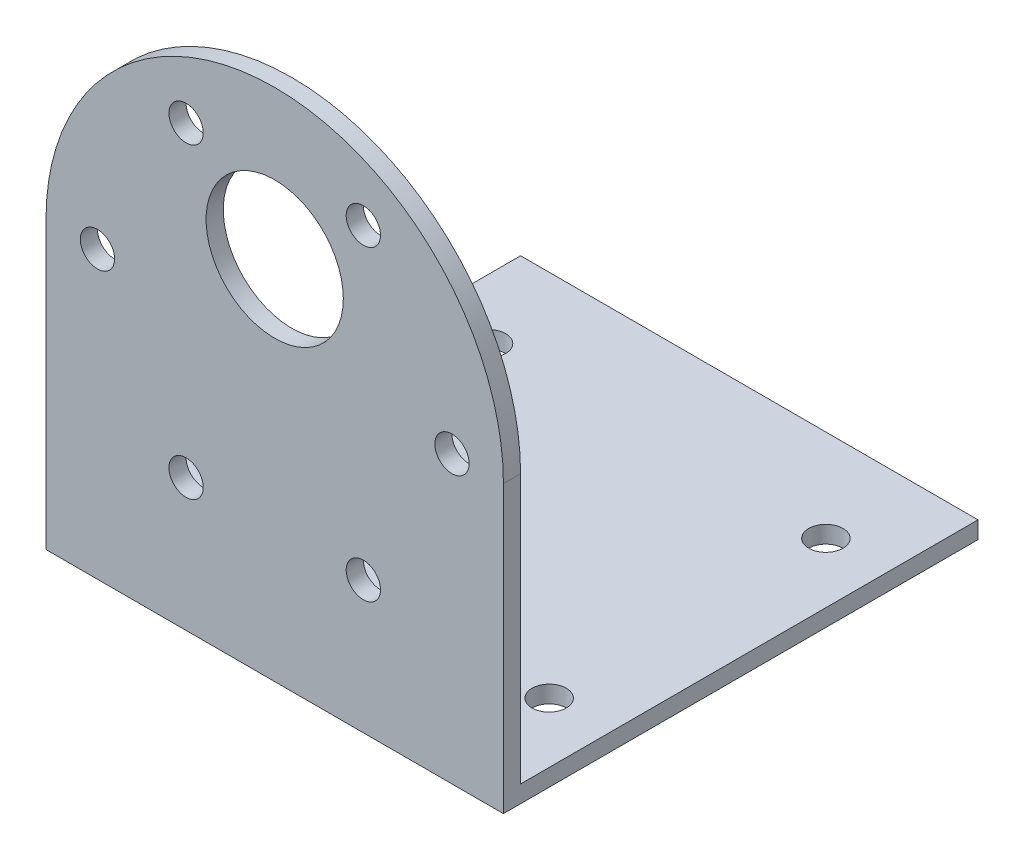
ISO-10303-21;
HEADER;
FILE_DESCRIPTION(('STEP AP214'),'2;1');
FILE_NAME('part.step','',(''),(''),'','','');
FILE_SCHEMA(('AUTOMOTIVE_DESIGN { 1 0 10303 214 1 1 1 1 }'));
ENDSEC;
DATA;
#1=APPLICATION_CONTEXT('core data for automotive mechanical design processes');
#2=APPLICATION_PROTOCOL_DEFINITION('international standard','automotive_design',2000,#1);
#3=PRODUCT_CONTEXT('',#1,'mechanical');
#4=PRODUCT('Part','Part','',(#3));
#5=PRODUCT_RELATED_PRODUCT_CATEGORY('part','',(#4));
#6=PRODUCT_DEFINITION_FORMATION('','',#4);
#7=PRODUCT_DEFINITION_CONTEXT('part definition',#1,'design');
#8=PRODUCT_DEFINITION('design','',#6,#7);
#9=PRODUCT_DEFINITION_SHAPE('','',#8);
#10=(LENGTH_UNIT() NAMED_UNIT(*) SI_UNIT(.MILLI.,.METRE.));
#11=(NAMED_UNIT(*) PLANE_ANGLE_UNIT() SI_UNIT($,.RADIAN.));
#12=(NAMED_UNIT(*) SI_UNIT($,.STERADIAN.) SOLID_ANGLE_UNIT());
#13=UNCERTAINTY_MEASURE_WITH_UNIT(LENGTH_MEASURE(1.E-05),#10,'distance_accuracy_value','');
#14=(GEOMETRIC_REPRESENTATION_CONTEXT(3) GLOBAL_UNCERTAINTY_ASSIGNED_CONTEXT((#13)) GLOBAL_UNIT_ASSIGNED_CONTEXT((#10,
#11,#12)) REPRESENTATION_CONTEXT('',''));
#15=CARTESIAN_POINT('',(0.,0.,0.));
#16=DIRECTION('',(0.,0.,1.));
#17=DIRECTION('',(1.,0.,0.));
#18=AXIS2_PLACEMENT_3D('',#15,#16,#17);
#19=CARTESIAN_POINT('',(20.,0.,1.5));
#20=DIRECTION('',(1.,0.,0.));
#21=DIRECTION('',(0.,0.,-1.));
#22=AXIS2_PLACEMENT_3D('',#19,#20,#21);
#23=PLANE('',#22);
#24=DIRECTION('',(0.,-1.,0.));
#25=VECTOR('',#24,1.);
#26=CARTESIAN_POINT('',(20.,0.,0.));
#27=LINE('',#26,#25);
#28=CARTESIAN_POINT('',(20.,0.,0.));
#29=VERTEX_POINT('',#28);
#30=CARTESIAN_POINT('',(20.,-23.5,0.));
#31=VERTEX_POINT('',#30);
#32=EDGE_CURVE('E172',#29,#31,#27,.T.);
#33=ORIENTED_EDGE('',*,*,#32,.F.);
#34=DIRECTION('',(0.,0.,-1.));
#35=VECTOR('',#34,1.);
#36=CARTESIAN_POINT('',(20.,0.,1.5));
#37=LINE('',#36,#35);
#38=CARTESIAN_POINT('',(20.,0.,1.5));
#39=VERTEX_POINT('',#38);
#40=EDGE_CURVE('E11',#39,#29,#37,.T.);
#41=ORIENTED_EDGE('',*,*,#40,.F.);
#42=DIRECTION('',(0.,-1.,0.));
#43=VECTOR('',#42,1.);
#44=CARTESIAN_POINT('',(20.,0.,1.5));
#45=LINE('',#44,#43);
#46=CARTESIAN_POINT('',(20.,-25.,1.5));
#47=VERTEX_POINT('',#46);
#48=EDGE_CURVE('E143',#39,#47,#45,.T.);
#49=ORIENTED_EDGE('',*,*,#48,.T.);
#50=DIRECTION('',(0.,0.,-1.));
#51=VECTOR('',#50,1.);
#52=CARTESIAN_POINT('',(20.,-25.,1.5));
#53=LINE('',#52,#51);
#54=CARTESIAN_POINT('',(20.,-25.,-40.));
#55=VERTEX_POINT('',#54);
#56=EDGE_CURVE('E60',#47,#55,#53,.T.);
#57=ORIENTED_EDGE('',*,*,#56,.T.);
#58=DIRECTION('',(0.,-1.,0.));
#59=VECTOR('',#58,1.);
#60=CARTESIAN_POINT('',(20.,0.,-40.));
#61=LINE('',#60,#59);
#62=CARTESIAN_POINT('',(20.,-23.5,-40.));
#63=VERTEX_POINT('',#62);
#64=EDGE_CURVE('E105',#63,#55,#61,.T.);
#65=ORIENTED_EDGE('',*,*,#64,.F.);
#66=DIRECTION('',(0.,0.,1.));
#67=VECTOR('',#66,1.);
#68=CARTESIAN_POINT('',(20.,-23.5,-40.));
#69=LINE('',#68,#67);
#70=EDGE_CURVE('E95',#63,#31,#69,.T.);
#71=ORIENTED_EDGE('',*,*,#70,.T.);
#72=EDGE_LOOP('',(#33,#41,#49,#57,#65,#71));
#73=FACE_BOUND('',#72,.T.);
#74=ADVANCED_FACE('F36',(#73),#23,.T.);
#75=CARTESIAN_POINT('',(0.,0.,1.5));
#76=DIRECTION('',(0.,0.,-1.));
#77=DIRECTION('',(-1.,0.,0.));
#78=AXIS2_PLACEMENT_3D('',#75,#76,#77);
#79=CYLINDRICAL_SURFACE('',#78,20.);
#80=CARTESIAN_POINT('',(0.,0.,0.));
#81=DIRECTION('',(0.,0.,1.));
#82=DIRECTION('',(1.,0.,0.));
#83=AXIS2_PLACEMENT_3D('',#80,#81,#82);
#84=CIRCLE('',#83,20.);
#85=CARTESIAN_POINT('',(-20.,0.,0.));
#86=VERTEX_POINT('',#85);
#87=EDGE_CURVE('E174',#29,#86,#84,.T.);
#88=ORIENTED_EDGE('',*,*,#87,.T.);
#89=DIRECTION('',(0.,0.,-1.));
#90=VECTOR('',#89,1.);
#91=CARTESIAN_POINT('',(-20.,0.,1.5));
#92=LINE('',#91,#90);
#93=CARTESIAN_POINT('',(-20.,0.,1.5));
#94=VERTEX_POINT('',#93);
#95=EDGE_CURVE('E44',#94,#86,#92,.T.);
#96=ORIENTED_EDGE('',*,*,#95,.F.);
#97=CARTESIAN_POINT('',(0.,0.,1.5));
#98=DIRECTION('',(0.,0.,1.));
#99=DIRECTION('',(1.,0.,0.));
#100=AXIS2_PLACEMENT_3D('',#97,#98,#99);
#101=CIRCLE('',#100,20.);
#102=EDGE_CURVE('E145',#39,#94,#101,.T.);
#103=ORIENTED_EDGE('',*,*,#102,.F.);
#104=ORIENTED_EDGE('',*,*,#40,.T.);
#105=EDGE_LOOP('',(#88,#96,#103,#104));
#106=FACE_BOUND('',#105,.T.);
#107=ADVANCED_FACE('F185',(#106),#79,.T.);
#108=CARTESIAN_POINT('',(-20.,0.,1.5));
#109=DIRECTION('',(1.,0.,0.));
#110=DIRECTION('',(0.,0.,-1.));
#111=AXIS2_PLACEMENT_3D('',#108,#109,#110);
#112=PLANE('',#111);
#113=DIRECTION('',(0.,-1.,0.));
#114=VECTOR('',#113,1.);
#115=CARTESIAN_POINT('',(-20.,0.,0.));
#116=LINE('',#115,#114);
#117=CARTESIAN_POINT('',(-20.,-23.5,0.));
#118=VERTEX_POINT('',#117);
#119=EDGE_CURVE('E75',#86,#118,#116,.T.);
#120=ORIENTED_EDGE('',*,*,#119,.T.);
#121=DIRECTION('',(0.,0.,1.));
#122=VECTOR('',#121,1.);
#123=CARTESIAN_POINT('',(-20.,-23.5,-40.));
#124=LINE('',#123,#122);
#125=CARTESIAN_POINT('',(-20.,-23.5,-40.));
#126=VERTEX_POINT('',#125);
#127=EDGE_CURVE('E51',#126,#118,#124,.T.);
#128=ORIENTED_EDGE('',*,*,#127,.F.);
#129=DIRECTION('',(0.,-1.,0.));
#130=VECTOR('',#129,1.);
#131=CARTESIAN_POINT('',(-20.,0.,-40.));
#132=LINE('',#131,#130);
#133=CARTESIAN_POINT('',(-20.,-25.,-40.));
#134=VERTEX_POINT('',#133);
#135=EDGE_CURVE('E112',#126,#134,#132,.T.);
#136=ORIENTED_EDGE('',*,*,#135,.T.);
#137=DIRECTION('',(0.,0.,-1.));
#138=VECTOR('',#137,1.);
#139=CARTESIAN_POINT('',(-20.,-25.,1.5));
#140=LINE('',#139,#138);
#141=CARTESIAN_POINT('',(-20.,-25.,1.5));
#142=VERTEX_POINT('',#141);
#143=EDGE_CURVE('E179',#142,#134,#140,.T.);
#144=ORIENTED_EDGE('',*,*,#143,.F.);
#145=DIRECTION('',(0.,-1.,0.));
#146=VECTOR('',#145,1.);
#147=CARTESIAN_POINT('',(-20.,0.,1.5));
#148=LINE('',#147,#146);
#149=EDGE_CURVE('E148',#94,#142,#148,.T.);
#150=ORIENTED_EDGE('',*,*,#149,.F.);
#151=ORIENTED_EDGE('',*,*,#95,.T.);
#152=EDGE_LOOP('',(#120,#128,#136,#144,#150,#151));
#153=FACE_BOUND('',#152,.T.);
#154=ADVANCED_FACE('F182',(#153),#112,.F.);
#155=CARTESIAN_POINT('',(-7.75000000000016,-13.4233937586587,1.5));
#156=DIRECTION('',(0.,0.,-1.));
#157=DIRECTION('',(-1.,0.,0.));
#158=AXIS2_PLACEMENT_3D('',#155,#156,#157);
#159=CYLINDRICAL_SURFACE('',#158,1.5);
#160=CARTESIAN_POINT('',(-7.75000000000016,-13.4233937586587,1.5));
#161=DIRECTION('',(0.,0.,1.));
#162=DIRECTION('',(1.,0.,0.));
#163=AXIS2_PLACEMENT_3D('',#160,#161,#162);
#164=CIRCLE('',#163,1.5);
#165=CARTESIAN_POINT('',(-6.25000000000015,-13.4233937586587,1.5));
#166=VERTEX_POINT('',#165);
#167=EDGE_CURVE('E140',#166,#166,#164,.T.);
#168=ORIENTED_EDGE('',*,*,#167,.T.);
#169=EDGE_LOOP('',(#168));
#170=FACE_BOUND('',#169,.T.);
#171=CARTESIAN_POINT('',(-7.75000000000016,-13.4233937586587,0.));
#172=DIRECTION('',(0.,0.,1.));
#173=DIRECTION('',(1.,0.,0.));
#174=AXIS2_PLACEMENT_3D('',#171,#172,#173);
#175=CIRCLE('',#174,1.5);
#176=CARTESIAN_POINT('',(-6.25000000000015,-13.4233937586587,0.));
#177=VERTEX_POINT('',#176);
#178=EDGE_CURVE('E169',#177,#177,#175,.T.);
#179=ORIENTED_EDGE('',*,*,#178,.F.);
#180=EDGE_LOOP('',(#179));
#181=FACE_BOUND('',#180,.T.);
#182=ADVANCED_FACE('F210',(#170,#181),#159,.F.);
#183=CARTESIAN_POINT('',(7.74999999999987,-13.4233937586589,1.5));
#184=DIRECTION('',(0.,0.,-1.));
#185=DIRECTION('',(-1.,0.,0.));
#186=AXIS2_PLACEMENT_3D('',#183,#184,#185);
#187=CYLINDRICAL_SURFACE('',#186,1.5);
#188=CARTESIAN_POINT('',(7.74999999999987,-13.4233937586589,1.5));
#189=DIRECTION('',(0.,0.,1.));
#190=DIRECTION('',(1.,0.,0.));
#191=AXIS2_PLACEMENT_3D('',#188,#189,#190);
#192=CIRCLE('',#191,1.5);
#193=CARTESIAN_POINT('',(9.24999999999988,-13.4233937586589,1.5));
#194=VERTEX_POINT('',#193);
#195=EDGE_CURVE('E137',#194,#194,#192,.T.);
#196=ORIENTED_EDGE('',*,*,#195,.T.);
#197=EDGE_LOOP('',(#196));
#198=FACE_BOUND('',#197,.T.);
#199=CARTESIAN_POINT('',(7.74999999999987,-13.4233937586589,0.));
#200=DIRECTION('',(0.,0.,1.));
#201=DIRECTION('',(1.,0.,0.));
#202=AXIS2_PLACEMENT_3D('',#199,#200,#201);
#203=CIRCLE('',#202,1.5);
#204=CARTESIAN_POINT('',(9.24999999999988,-13.4233937586589,0.));
#205=VERTEX_POINT('',#204);
#206=EDGE_CURVE('E166',#205,#205,#203,.T.);
#207=ORIENTED_EDGE('',*,*,#206,.F.);
#208=EDGE_LOOP('',(#207));
#209=FACE_BOUND('',#208,.T.);
#210=ADVANCED_FACE('F213',(#198,#209),#187,.F.);
#211=CARTESIAN_POINT('',(15.5,-1.08235921504137E-13,1.5));
#212=DIRECTION('',(0.,0.,-1.));
#213=DIRECTION('',(-1.,0.,0.));
#214=AXIS2_PLACEMENT_3D('',#211,#212,#213);
#215=CYLINDRICAL_SURFACE('',#214,1.5);
#216=CARTESIAN_POINT('',(15.5,-1.08235921504137E-13,1.5));
#217=DIRECTION('',(0.,0.,1.));
#218=DIRECTION('',(1.,0.,0.));
#219=AXIS2_PLACEMENT_3D('',#216,#217,#218);
#220=CIRCLE('',#219,1.5);
#221=CARTESIAN_POINT('',(17.,-1.08235921504137E-13,1.5));
#222=VERTEX_POINT('',#221);
#223=EDGE_CURVE('E134',#222,#222,#220,.T.);
#224=ORIENTED_EDGE('',*,*,#223,.T.);
#225=EDGE_LOOP('',(#224));
#226=FACE_BOUND('',#225,.T.);
#227=CARTESIAN_POINT('',(15.5,-1.08235921504137E-13,0.));
#228=DIRECTION('',(0.,0.,1.));
#229=DIRECTION('',(1.,0.,0.));
#230=AXIS2_PLACEMENT_3D('',#227,#228,#229);
#231=CIRCLE('',#230,1.5);
#232=CARTESIAN_POINT('',(17.,-1.08235921504137E-13,0.));
#233=VERTEX_POINT('',#232);
#234=EDGE_CURVE('E163',#233,#233,#231,.T.);
#235=ORIENTED_EDGE('',*,*,#234,.F.);
#236=EDGE_LOOP('',(#235));
#237=FACE_BOUND('',#236,.T.);
#238=ADVANCED_FACE('F217',(#226,#237),#215,.F.);
#239=CARTESIAN_POINT('',(7.75000000000006,13.4233937586588,1.5));
#240=DIRECTION('',(0.,0.,-1.));
#241=DIRECTION('',(-1.,0.,0.));
#242=AXIS2_PLACEMENT_3D('',#239,#240,#241);
#243=CYLINDRICAL_SURFACE('',#242,1.5);
#244=CARTESIAN_POINT('',(7.75000000000006,13.4233937586588,1.5));
#245=DIRECTION('',(0.,0.,1.));
#246=DIRECTION('',(1.,0.,0.));
#247=AXIS2_PLACEMENT_3D('',#244,#245,#246);
#248=CIRCLE('',#247,1.5);
#249=CARTESIAN_POINT('',(9.25000000000006,13.4233937586588,1.5));
#250=VERTEX_POINT('',#249);
#251=EDGE_CURVE('E131',#250,#250,#248,.T.);
#252=ORIENTED_EDGE('',*,*,#251,.T.);
#253=EDGE_LOOP('',(#252));
#254=FACE_BOUND('',#253,.T.);
#255=CARTESIAN_POINT('',(7.75000000000006,13.4233937586588,0.));
#256=DIRECTION('',(0.,0.,1.));
#257=DIRECTION('',(1.,0.,0.));
#258=AXIS2_PLACEMENT_3D('',#255,#256,#257);
#259=CIRCLE('',#258,1.5);
#260=CARTESIAN_POINT('',(9.25000000000006,13.4233937586588,0.));
#261=VERTEX_POINT('',#260);
#262=EDGE_CURVE('E160',#261,#261,#259,.T.);
#263=ORIENTED_EDGE('',*,*,#262,.F.);
#264=EDGE_LOOP('',(#263));
#265=FACE_BOUND('',#264,.T.);
#266=ADVANCED_FACE('F221',(#254,#265),#243,.F.);
#267=CARTESIAN_POINT('',(-7.74999999999997,13.4233937586588,1.5));
#268=DIRECTION('',(0.,0.,-1.));
#269=DIRECTION('',(-1.,0.,0.));
#270=AXIS2_PLACEMENT_3D('',#267,#268,#269);
#271=CYLINDRICAL_SURFACE('',#270,1.5);
#272=CARTESIAN_POINT('',(-7.74999999999997,13.4233937586588,1.5));
#273=DIRECTION('',(0.,0.,1.));
#274=DIRECTION('',(1.,0.,0.));
#275=AXIS2_PLACEMENT_3D('',#272,#273,#274);
#276=CIRCLE('',#275,1.5);
#277=CARTESIAN_POINT('',(-6.24999999999997,13.4233937586588,1.5));
#278=VERTEX_POINT('',#277);
#279=EDGE_CURVE('E128',#278,#278,#276,.T.);
#280=ORIENTED_EDGE('',*,*,#279,.T.);
#281=EDGE_LOOP('',(#280));
#282=FACE_BOUND('',#281,.T.);
#283=CARTESIAN_POINT('',(-7.74999999999997,13.4233937586588,0.));
#284=DIRECTION('',(0.,0.,1.));
#285=DIRECTION('',(1.,0.,0.));
#286=AXIS2_PLACEMENT_3D('',#283,#284,#285);
#287=CIRCLE('',#286,1.5);
#288=CARTESIAN_POINT('',(-6.24999999999997,13.4233937586588,0.));
#289=VERTEX_POINT('',#288);
#290=EDGE_CURVE('E157',#289,#289,#287,.T.);
#291=ORIENTED_EDGE('',*,*,#290,.F.);
#292=EDGE_LOOP('',(#291));
#293=FACE_BOUND('',#292,.T.);
#294=ADVANCED_FACE('F225',(#282,#293),#271,.F.);
#295=CARTESIAN_POINT('',(-15.5,0.,1.5));
#296=DIRECTION('',(0.,0.,-1.));
#297=DIRECTION('',(-1.,0.,0.));
#298=AXIS2_PLACEMENT_3D('',#295,#296,#297);
#299=CYLINDRICAL_SURFACE('',#298,1.5);
#300=CARTESIAN_POINT('',(-15.5,0.,1.5));
#301=DIRECTION('',(0.,0.,1.));
#302=DIRECTION('',(1.,0.,0.));
#303=AXIS2_PLACEMENT_3D('',#300,#301,#302);
#304=CIRCLE('',#303,1.5);
#305=CARTESIAN_POINT('',(-14.,0.,1.5));
#306=VERTEX_POINT('',#305);
#307=EDGE_CURVE('E125',#306,#306,#304,.T.);
#308=ORIENTED_EDGE('',*,*,#307,.T.);
#309=EDGE_LOOP('',(#308));
#310=FACE_BOUND('',#309,.T.);
#311=CARTESIAN_POINT('',(-15.5,0.,0.));
#312=DIRECTION('',(0.,0.,1.));
#313=DIRECTION('',(1.,0.,0.));
#314=AXIS2_PLACEMENT_3D('',#311,#312,#313);
#315=CIRCLE('',#314,1.5);
#316=CARTESIAN_POINT('',(-14.,0.,0.));
#317=VERTEX_POINT('',#316);
#318=EDGE_CURVE('E154',#317,#317,#315,.T.);
#319=ORIENTED_EDGE('',*,*,#318,.F.);
#320=EDGE_LOOP('',(#319));
#321=FACE_BOUND('',#320,.T.);
#322=ADVANCED_FACE('F228',(#310,#321),#299,.F.);
#323=CARTESIAN_POINT('',(0.,7.,1.5));
#324=DIRECTION('',(0.,0.,-1.));
#325=DIRECTION('',(-1.,0.,0.));
#326=AXIS2_PLACEMENT_3D('',#323,#324,#325);
#327=CYLINDRICAL_SURFACE('',#326,6.);
#328=CARTESIAN_POINT('',(0.,7.,1.5));
#329=DIRECTION('',(0.,0.,1.));
#330=DIRECTION('',(1.,0.,0.));
#331=AXIS2_PLACEMENT_3D('',#328,#329,#330);
#332=CIRCLE('',#331,6.);
#333=CARTESIAN_POINT('',(6.,7.,1.5));
#334=VERTEX_POINT('',#333);
#335=EDGE_CURVE('E122',#334,#334,#332,.T.);
#336=ORIENTED_EDGE('',*,*,#335,.T.);
#337=EDGE_LOOP('',(#336));
#338=FACE_BOUND('',#337,.T.);
#339=CARTESIAN_POINT('',(0.,7.,0.));
#340=DIRECTION('',(0.,0.,1.));
#341=DIRECTION('',(1.,0.,0.));
#342=AXIS2_PLACEMENT_3D('',#339,#340,#341);
#343=CIRCLE('',#342,6.);
#344=CARTESIAN_POINT('',(6.,7.,0.));
#345=VERTEX_POINT('',#344);
#346=EDGE_CURVE('E120',#345,#345,#343,.T.);
#347=ORIENTED_EDGE('',*,*,#346,.F.);
#348=EDGE_LOOP('',(#347));
#349=FACE_BOUND('',#348,.T.);
#350=ADVANCED_FACE('F38',(#338,#349),#327,.F.);
#351=CARTESIAN_POINT('',(0.,-25.,1.5));
#352=DIRECTION('',(0.,-1.,0.));
#353=DIRECTION('',(0.,0.,-1.));
#354=AXIS2_PLACEMENT_3D('',#351,#352,#353);
#355=PLANE('',#354);
#356=CARTESIAN_POINT('',(-14.75,-25.,-7.75));
#357=DIRECTION('',(0.,1.,0.));
#358=DIRECTION('',(0.,0.,1.));
#359=AXIS2_PLACEMENT_3D('',#356,#357,#358);
#360=CIRCLE('',#359,1.5);
#361=CARTESIAN_POINT('',(-14.75,-25.,-6.25));
#362=VERTEX_POINT('',#361);
#363=EDGE_CURVE('E406',#362,#362,#360,.T.);
#364=ORIENTED_EDGE('',*,*,#363,.T.);
#365=EDGE_LOOP('',(#364));
#366=FACE_BOUND('',#365,.T.);
#367=CARTESIAN_POINT('',(14.75,-25.,-7.75));
#368=DIRECTION('',(0.,1.,0.));
#369=DIRECTION('',(0.,0.,-1.));
#370=AXIS2_PLACEMENT_3D('',#367,#368,#369);
#371=CIRCLE('',#370,1.5);
#372=CARTESIAN_POINT('',(14.75,-25.,-9.25));
#373=VERTEX_POINT('',#372);
#374=EDGE_CURVE('E410',#373,#373,#371,.T.);
#375=ORIENTED_EDGE('',*,*,#374,.T.);
#376=EDGE_LOOP('',(#375));
#377=FACE_BOUND('',#376,.T.);
#378=CARTESIAN_POINT('',(14.75,-25.,-31.95));
#379=DIRECTION('',(0.,1.,0.));
#380=DIRECTION('',(0.,0.,-1.));
#381=AXIS2_PLACEMENT_3D('',#378,#379,#380);
#382=CIRCLE('',#381,1.5);
#383=CARTESIAN_POINT('',(14.75,-25.,-33.45));
#384=VERTEX_POINT('',#383);
#385=EDGE_CURVE('E420',#384,#384,#382,.T.);
#386=ORIENTED_EDGE('',*,*,#385,.T.);
#387=EDGE_LOOP('',(#386));
#388=FACE_BOUND('',#387,.T.);
#389=CARTESIAN_POINT('',(-14.75,-25.,-31.95));
#390=DIRECTION('',(0.,1.,0.));
#391=DIRECTION('',(0.,0.,1.));
#392=AXIS2_PLACEMENT_3D('',#389,#390,#391);
#393=CIRCLE('',#392,1.5);
#394=CARTESIAN_POINT('',(-14.75,-25.,-30.45));
#395=VERTEX_POINT('',#394);
#396=EDGE_CURVE('E119',#395,#395,#393,.T.);
#397=ORIENTED_EDGE('',*,*,#396,.T.);
#398=EDGE_LOOP('',(#397));
#399=FACE_BOUND('',#398,.T.);
#400=ORIENTED_EDGE('',*,*,#143,.T.);
#401=DIRECTION('',(-1.,0.,0.));
#402=VECTOR('',#401,1.);
#403=CARTESIAN_POINT('',(0.,-25.,-40.));
#404=LINE('',#403,#402);
#405=EDGE_CURVE('E102',#55,#134,#404,.T.);
#406=ORIENTED_EDGE('',*,*,#405,.F.);
#407=ORIENTED_EDGE('',*,*,#56,.F.);
#408=DIRECTION('',(-1.,0.,0.));
#409=VECTOR('',#408,1.);
#410=CARTESIAN_POINT('',(0.,-25.,1.5));
#411=LINE('',#410,#409);
#412=EDGE_CURVE('E150',#47,#142,#411,.T.);
#413=ORIENTED_EDGE('',*,*,#412,.T.);
#414=EDGE_LOOP('',(#400,#406,#407,#413));
#415=FACE_BOUND('',#414,.T.);
#416=ADVANCED_FACE('F197',(#366,#377,#388,#399,#415),#355,.T.);
#417=CARTESIAN_POINT('',(0.,0.,1.5));
#418=DIRECTION('',(0.,0.,1.));
#419=DIRECTION('',(1.,0.,0.));
#420=AXIS2_PLACEMENT_3D('',#417,#418,#419);
#421=PLANE('',#420);
#422=ORIENTED_EDGE('',*,*,#335,.F.);
#423=EDGE_LOOP('',(#422));
#424=FACE_BOUND('',#423,.T.);
#425=ORIENTED_EDGE('',*,*,#307,.F.);
#426=EDGE_LOOP('',(#425));
#427=FACE_BOUND('',#426,.T.);
#428=ORIENTED_EDGE('',*,*,#279,.F.);
#429=EDGE_LOOP('',(#428));
#430=FACE_BOUND('',#429,.T.);
#431=ORIENTED_EDGE('',*,*,#251,.F.);
#432=EDGE_LOOP('',(#431));
#433=FACE_BOUND('',#432,.T.);
#434=ORIENTED_EDGE('',*,*,#223,.F.);
#435=EDGE_LOOP('',(#434));
#436=FACE_BOUND('',#435,.T.);
#437=ORIENTED_EDGE('',*,*,#195,.F.);
#438=EDGE_LOOP('',(#437));
#439=FACE_BOUND('',#438,.T.);
#440=ORIENTED_EDGE('',*,*,#167,.F.);
#441=EDGE_LOOP('',(#440));
#442=FACE_BOUND('',#441,.T.);
#443=ORIENTED_EDGE('',*,*,#48,.F.);
#444=ORIENTED_EDGE('',*,*,#102,.T.);
#445=ORIENTED_EDGE('',*,*,#149,.T.);
#446=ORIENTED_EDGE('',*,*,#412,.F.);
#447=EDGE_LOOP('',(#443,#444,#445,#446));
#448=FACE_BOUND('',#447,.T.);
#449=ADVANCED_FACE('F188',(#424,#427,#430,#433,#436,#439,#442,#448),#421,.T.);
#450=CARTESIAN_POINT('',(0.,0.,0.));
#451=DIRECTION('',(0.,0.,1.));
#452=DIRECTION('',(1.,0.,0.));
#453=AXIS2_PLACEMENT_3D('',#450,#451,#452);
#454=PLANE('',#453);
#455=ORIENTED_EDGE('',*,*,#346,.T.);
#456=EDGE_LOOP('',(#455));
#457=FACE_BOUND('',#456,.T.);
#458=ORIENTED_EDGE('',*,*,#318,.T.);
#459=EDGE_LOOP('',(#458));
#460=FACE_BOUND('',#459,.T.);
#461=ORIENTED_EDGE('',*,*,#290,.T.);
#462=EDGE_LOOP('',(#461));
#463=FACE_BOUND('',#462,.T.);
#464=ORIENTED_EDGE('',*,*,#262,.T.);
#465=EDGE_LOOP('',(#464));
#466=FACE_BOUND('',#465,.T.);
#467=ORIENTED_EDGE('',*,*,#234,.T.);
#468=EDGE_LOOP('',(#467));
#469=FACE_BOUND('',#468,.T.);
#470=ORIENTED_EDGE('',*,*,#206,.T.);
#471=EDGE_LOOP('',(#470));
#472=FACE_BOUND('',#471,.T.);
#473=ORIENTED_EDGE('',*,*,#178,.T.);
#474=EDGE_LOOP('',(#473));
#475=FACE_BOUND('',#474,.T.);
#476=ORIENTED_EDGE('',*,*,#32,.T.);
#477=DIRECTION('',(-1.,0.,0.));
#478=VECTOR('',#477,1.);
#479=CARTESIAN_POINT('',(0.,-23.5,0.));
#480=LINE('',#479,#478);
#481=EDGE_CURVE('E100',#31,#118,#480,.T.);
#482=ORIENTED_EDGE('',*,*,#481,.T.);
#483=ORIENTED_EDGE('',*,*,#119,.F.);
#484=ORIENTED_EDGE('',*,*,#87,.F.);
#485=EDGE_LOOP('',(#476,#482,#483,#484));
#486=FACE_BOUND('',#485,.T.);
#487=ADVANCED_FACE('F186',(#457,#460,#463,#466,#469,#472,#475,#486),#454,.F.);
#488=CARTESIAN_POINT('',(0.,-23.5,-40.));
#489=DIRECTION('',(0.,1.,0.));
#490=DIRECTION('',(0.,0.,1.));
#491=AXIS2_PLACEMENT_3D('',#488,#489,#490);
#492=PLANE('',#491);
#493=CARTESIAN_POINT('',(-14.75,-23.5,-7.75));
#494=DIRECTION('',(0.,1.,0.));
#495=DIRECTION('',(0.,0.,1.));
#496=AXIS2_PLACEMENT_3D('',#493,#494,#495);
#497=CIRCLE('',#496,1.5);
#498=CARTESIAN_POINT('',(-14.75,-23.5,-6.25));
#499=VERTEX_POINT('',#498);
#500=EDGE_CURVE('E409',#499,#499,#497,.T.);
#501=ORIENTED_EDGE('',*,*,#500,.F.);
#502=EDGE_LOOP('',(#501));
#503=FACE_BOUND('',#502,.T.);
#504=CARTESIAN_POINT('',(14.75,-23.5,-7.75));
#505=DIRECTION('',(0.,1.,0.));
#506=DIRECTION('',(0.,0.,-1.));
#507=AXIS2_PLACEMENT_3D('',#504,#505,#506);
#508=CIRCLE('',#507,1.5);
#509=CARTESIAN_POINT('',(14.75,-23.5,-9.25));
#510=VERTEX_POINT('',#509);
#511=EDGE_CURVE('E415',#510,#510,#508,.T.);
#512=ORIENTED_EDGE('',*,*,#511,.F.);
#513=EDGE_LOOP('',(#512));
#514=FACE_BOUND('',#513,.T.);
#515=CARTESIAN_POINT('',(14.75,-23.5,-31.95));
#516=DIRECTION('',(0.,1.,0.));
#517=DIRECTION('',(0.,0.,-1.));
#518=AXIS2_PLACEMENT_3D('',#515,#516,#517);
#519=CIRCLE('',#518,1.5);
#520=CARTESIAN_POINT('',(14.75,-23.5,-33.45));
#521=VERTEX_POINT('',#520);
#522=EDGE_CURVE('E423',#521,#521,#519,.T.);
#523=ORIENTED_EDGE('',*,*,#522,.F.);
#524=EDGE_LOOP('',(#523));
#525=FACE_BOUND('',#524,.T.);
#526=CARTESIAN_POINT('',(-14.75,-23.5,-31.95));
#527=DIRECTION('',(0.,1.,0.));
#528=DIRECTION('',(0.,0.,1.));
#529=AXIS2_PLACEMENT_3D('',#526,#527,#528);
#530=CIRCLE('',#529,1.5);
#531=CARTESIAN_POINT('',(-14.75,-23.5,-30.45));
#532=VERTEX_POINT('',#531);
#533=EDGE_CURVE('E412',#532,#532,#530,.T.);
#534=ORIENTED_EDGE('',*,*,#533,.F.);
#535=EDGE_LOOP('',(#534));
#536=FACE_BOUND('',#535,.T.);
#537=ORIENTED_EDGE('',*,*,#481,.F.);
#538=ORIENTED_EDGE('',*,*,#70,.F.);
#539=DIRECTION('',(-1.,0.,0.));
#540=VECTOR('',#539,1.);
#541=CARTESIAN_POINT('',(0.,-23.5,-40.));
#542=LINE('',#541,#540);
#543=EDGE_CURVE('E99',#63,#126,#542,.T.);
#544=ORIENTED_EDGE('',*,*,#543,.T.);
#545=ORIENTED_EDGE('',*,*,#127,.T.);
#546=EDGE_LOOP('',(#537,#538,#544,#545));
#547=FACE_BOUND('',#546,.T.);
#548=ADVANCED_FACE('F97',(#503,#514,#525,#536,#547),#492,.T.);
#549=CARTESIAN_POINT('',(0.,0.,-40.));
#550=DIRECTION('',(0.,0.,1.));
#551=DIRECTION('',(1.,0.,0.));
#552=AXIS2_PLACEMENT_3D('',#549,#550,#551);
#553=PLANE('',#552);
#554=ORIENTED_EDGE('',*,*,#64,.T.);
#555=ORIENTED_EDGE('',*,*,#405,.T.);
#556=ORIENTED_EDGE('',*,*,#135,.F.);
#557=ORIENTED_EDGE('',*,*,#543,.F.);
#558=EDGE_LOOP('',(#554,#555,#556,#557));
#559=FACE_BOUND('',#558,.T.);
#560=ADVANCED_FACE('F110',(#559),#553,.F.);
#561=CARTESIAN_POINT('',(-14.75,-25.,-31.95));
#562=DIRECTION('',(0.,1.,0.));
#563=DIRECTION('',(0.,0.,1.));
#564=AXIS2_PLACEMENT_3D('',#561,#562,#563);
#565=CYLINDRICAL_SURFACE('',#564,1.5);
#566=ORIENTED_EDGE('',*,*,#396,.F.);
#567=EDGE_LOOP('',(#566));
#568=FACE_BOUND('',#567,.T.);
#569=ORIENTED_EDGE('',*,*,#533,.T.);
#570=EDGE_LOOP('',(#569));
#571=FACE_BOUND('',#570,.T.);
#572=ADVANCED_FACE('F362',(#568,#571),#565,.F.);
#573=CARTESIAN_POINT('',(14.75,-25.,-31.95));
#574=DIRECTION('',(0.,1.,0.));
#575=DIRECTION('',(0.,0.,1.));
#576=AXIS2_PLACEMENT_3D('',#573,#574,#575);
#577=CYLINDRICAL_SURFACE('',#576,1.5);
#578=ORIENTED_EDGE('',*,*,#385,.F.);
#579=EDGE_LOOP('',(#578));
#580=FACE_BOUND('',#579,.T.);
#581=ORIENTED_EDGE('',*,*,#522,.T.);
#582=EDGE_LOOP('',(#581));
#583=FACE_BOUND('',#582,.T.);
#584=ADVANCED_FACE('F369',(#580,#583),#577,.F.);
#585=CARTESIAN_POINT('',(14.75,-25.,-7.75));
#586=DIRECTION('',(0.,1.,0.));
#587=DIRECTION('',(0.,0.,1.));
#588=AXIS2_PLACEMENT_3D('',#585,#586,#587);
#589=CYLINDRICAL_SURFACE('',#588,1.5);
#590=ORIENTED_EDGE('',*,*,#374,.F.);
#591=EDGE_LOOP('',(#590));
#592=FACE_BOUND('',#591,.T.);
#593=ORIENTED_EDGE('',*,*,#511,.T.);
#594=EDGE_LOOP('',(#593));
#595=FACE_BOUND('',#594,.T.);
#596=ADVANCED_FACE('F378',(#592,#595),#589,.F.);
#597=CARTESIAN_POINT('',(-14.75,-25.,-7.75));
#598=DIRECTION('',(0.,1.,0.));
#599=DIRECTION('',(0.,0.,1.));
#600=AXIS2_PLACEMENT_3D('',#597,#598,#599);
#601=CYLINDRICAL_SURFACE('',#600,1.5);
#602=ORIENTED_EDGE('',*,*,#363,.F.);
#603=EDGE_LOOP('',(#602));
#604=FACE_BOUND('',#603,.T.);
#605=ORIENTED_EDGE('',*,*,#500,.T.);
#606=EDGE_LOOP('',(#605));
#607=FACE_BOUND('',#606,.T.);
#608=ADVANCED_FACE('F387',(#604,#607),#601,.F.);
#609=CLOSED_SHELL('',(#74,#107,#154,#182,#210,#238,#266,#294,#322,#350,#416,#449,#487,#548,#560,
#572,#584,#596,#608));
#610=MANIFOLD_SOLID_BREP('B2',#609);
#611=ADVANCED_BREP_SHAPE_REPRESENTATION('',(#18,#610),#14);
#612=SHAPE_DEFINITION_REPRESENTATION(#9,#611);
ENDSEC;
END-ISO-10303-21;
